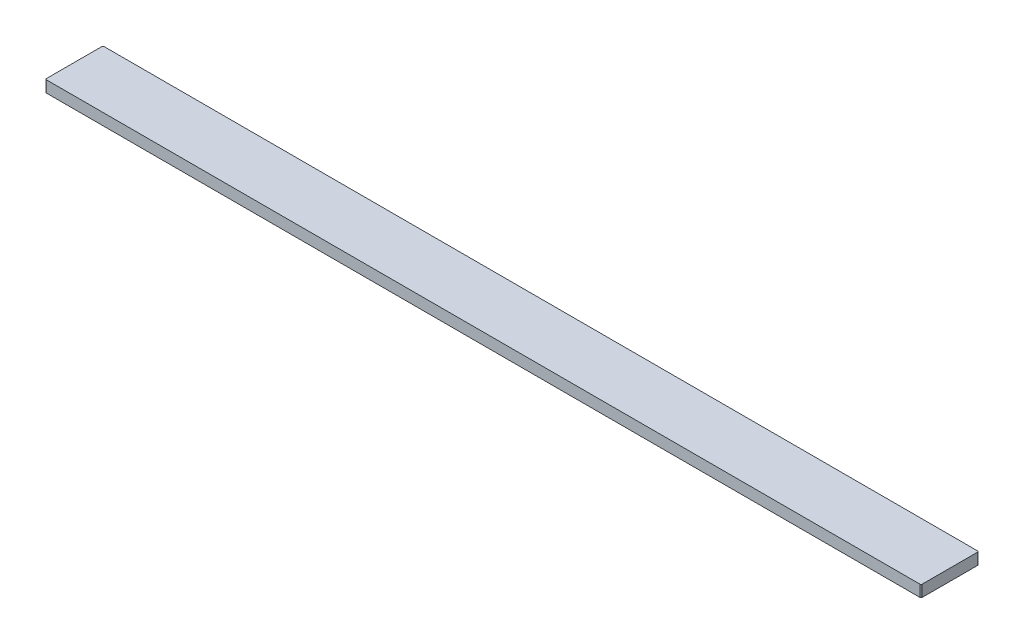
ISO-10303-21;
HEADER;
FILE_DESCRIPTION(('STEP AP214'),'2;1');
FILE_NAME('part.step','',(''),(''),'','','');
FILE_SCHEMA(('AUTOMOTIVE_DESIGN { 1 0 10303 214 1 1 1 1 }'));
ENDSEC;
DATA;
#1=APPLICATION_CONTEXT('core data for automotive mechanical design processes');
#2=APPLICATION_PROTOCOL_DEFINITION('international standard','automotive_design',2000,#1);
#3=PRODUCT_CONTEXT('',#1,'mechanical');
#4=PRODUCT('Part','Part','',(#3));
#5=PRODUCT_RELATED_PRODUCT_CATEGORY('part','',(#4));
#6=PRODUCT_DEFINITION_FORMATION('','',#4);
#7=PRODUCT_DEFINITION_CONTEXT('part definition',#1,'design');
#8=PRODUCT_DEFINITION('design','',#6,#7);
#9=PRODUCT_DEFINITION_SHAPE('','',#8);
#10=(LENGTH_UNIT() NAMED_UNIT(*) SI_UNIT(.MILLI.,.METRE.));
#11=(NAMED_UNIT(*) PLANE_ANGLE_UNIT() SI_UNIT($,.RADIAN.));
#12=(NAMED_UNIT(*) SI_UNIT($,.STERADIAN.) SOLID_ANGLE_UNIT());
#13=UNCERTAINTY_MEASURE_WITH_UNIT(LENGTH_MEASURE(1.E-05),#10,'distance_accuracy_value','');
#14=(GEOMETRIC_REPRESENTATION_CONTEXT(3) GLOBAL_UNCERTAINTY_ASSIGNED_CONTEXT((#13)) GLOBAL_UNIT_ASSIGNED_CONTEXT((#10,
#11,#12)) REPRESENTATION_CONTEXT('',''));
#15=CARTESIAN_POINT('',(0.,0.,0.));
#16=DIRECTION('',(0.,0.,1.));
#17=DIRECTION('',(1.,0.,0.));
#18=AXIS2_PLACEMENT_3D('',#15,#16,#17);
#19=CARTESIAN_POINT('',(-380.,-10.,-50.));
#20=DIRECTION('',(-1.,0.,0.));
#21=DIRECTION('',(0.,0.,1.));
#22=AXIS2_PLACEMENT_3D('',#19,#20,#21);
#23=PLANE('',#22);
#24=DIRECTION('',(0.,0.,1.));
#25=VECTOR('',#24,1.);
#26=CARTESIAN_POINT('',(-380.,0.,-50.));
#27=LINE('',#26,#25);
#28=CARTESIAN_POINT('',(-380.,0.,-49.));
#29=VERTEX_POINT('',#28);
#30=CARTESIAN_POINT('',(-380.,0.,-1.));
#31=VERTEX_POINT('',#30);
#32=EDGE_CURVE('E156',#29,#31,#27,.T.);
#33=ORIENTED_EDGE('',*,*,#32,.F.);
#34=DIRECTION('',(0.,1.,0.));
#35=VECTOR('',#34,1.);
#36=CARTESIAN_POINT('',(-380.,-10.,-49.));
#37=LINE('',#36,#35);
#38=CARTESIAN_POINT('',(-380.,-10.,-49.));
#39=VERTEX_POINT('',#38);
#40=EDGE_CURVE('E11',#29,#39,#37,.F.);
#41=ORIENTED_EDGE('',*,*,#40,.T.);
#42=DIRECTION('',(0.,0.,1.));
#43=VECTOR('',#42,1.);
#44=CARTESIAN_POINT('',(-380.,-10.,-50.));
#45=LINE('',#44,#43);
#46=CARTESIAN_POINT('',(-380.,-10.,-1.));
#47=VERTEX_POINT('',#46);
#48=EDGE_CURVE('E159',#39,#47,#45,.T.);
#49=ORIENTED_EDGE('',*,*,#48,.T.);
#50=DIRECTION('',(0.,1.,0.));
#51=VECTOR('',#50,1.);
#52=CARTESIAN_POINT('',(-380.,-10.,-1.));
#53=LINE('',#52,#51);
#54=EDGE_CURVE('E44',#47,#31,#53,.T.);
#55=ORIENTED_EDGE('',*,*,#54,.T.);
#56=EDGE_LOOP('',(#33,#41,#49,#55));
#57=FACE_BOUND('',#56,.T.);
#58=ADVANCED_FACE('F36',(#57),#23,.T.);
#59=CARTESIAN_POINT('',(-380.,-10.,-50.));
#60=DIRECTION('',(0.,0.,-1.));
#61=DIRECTION('',(-1.,0.,0.));
#62=AXIS2_PLACEMENT_3D('',#59,#60,#61);
#63=PLANE('',#62);
#64=DIRECTION('',(-1.,0.,0.));
#65=VECTOR('',#64,1.);
#66=CARTESIAN_POINT('',(-380.,0.,-50.));
#67=LINE('',#66,#65);
#68=CARTESIAN_POINT('',(379.,0.,-50.));
#69=VERTEX_POINT('',#68);
#70=CARTESIAN_POINT('',(-379.,0.,-50.));
#71=VERTEX_POINT('',#70);
#72=EDGE_CURVE('E121',#69,#71,#67,.T.);
#73=ORIENTED_EDGE('',*,*,#72,.F.);
#74=DIRECTION('',(0.,1.,0.));
#75=VECTOR('',#74,1.);
#76=CARTESIAN_POINT('',(379.,-10.,-50.));
#77=LINE('',#76,#75);
#78=CARTESIAN_POINT('',(379.,-10.,-50.));
#79=VERTEX_POINT('',#78);
#80=EDGE_CURVE('E139',#69,#79,#77,.F.);
#81=ORIENTED_EDGE('',*,*,#80,.T.);
#82=DIRECTION('',(-1.,0.,0.));
#83=VECTOR('',#82,1.);
#84=CARTESIAN_POINT('',(-380.,-10.,-50.));
#85=LINE('',#84,#83);
#86=CARTESIAN_POINT('',(-379.,-10.,-50.));
#87=VERTEX_POINT('',#86);
#88=EDGE_CURVE('E124',#79,#87,#85,.T.);
#89=ORIENTED_EDGE('',*,*,#88,.T.);
#90=DIRECTION('',(0.,1.,0.));
#91=VECTOR('',#90,1.);
#92=CARTESIAN_POINT('',(-379.,-10.,-50.));
#93=LINE('',#92,#91);
#94=EDGE_CURVE('E136',#87,#71,#93,.T.);
#95=ORIENTED_EDGE('',*,*,#94,.T.);
#96=EDGE_LOOP('',(#73,#81,#89,#95));
#97=FACE_BOUND('',#96,.T.);
#98=ADVANCED_FACE('F172',(#97),#63,.T.);
#99=CARTESIAN_POINT('',(380.,-10.,-50.));
#100=DIRECTION('',(1.,0.,0.));
#101=DIRECTION('',(0.,0.,-1.));
#102=AXIS2_PLACEMENT_3D('',#99,#100,#101);
#103=PLANE('',#102);
#104=DIRECTION('',(0.,0.,-1.));
#105=VECTOR('',#104,1.);
#106=CARTESIAN_POINT('',(380.,-10.,-50.));
#107=LINE('',#106,#105);
#108=CARTESIAN_POINT('',(380.,-10.,-1.));
#109=VERTEX_POINT('',#108);
#110=CARTESIAN_POINT('',(380.,-10.,-49.));
#111=VERTEX_POINT('',#110);
#112=EDGE_CURVE('E129',#109,#111,#107,.T.);
#113=ORIENTED_EDGE('',*,*,#112,.T.);
#114=DIRECTION('',(0.,1.,0.));
#115=VECTOR('',#114,1.);
#116=CARTESIAN_POINT('',(380.,-10.,-49.));
#117=LINE('',#116,#115);
#118=CARTESIAN_POINT('',(380.,0.,-49.));
#119=VERTEX_POINT('',#118);
#120=EDGE_CURVE('E120',#111,#119,#117,.T.);
#121=ORIENTED_EDGE('',*,*,#120,.T.);
#122=DIRECTION('',(0.,0.,-1.));
#123=VECTOR('',#122,1.);
#124=CARTESIAN_POINT('',(380.,0.,-50.));
#125=LINE('',#124,#123);
#126=CARTESIAN_POINT('',(380.,0.,-1.));
#127=VERTEX_POINT('',#126);
#128=EDGE_CURVE('E105',#127,#119,#125,.T.);
#129=ORIENTED_EDGE('',*,*,#128,.F.);
#130=DIRECTION('',(0.,1.,0.));
#131=VECTOR('',#130,1.);
#132=CARTESIAN_POINT('',(380.,-10.,-1.));
#133=LINE('',#132,#131);
#134=EDGE_CURVE('E118',#127,#109,#133,.F.);
#135=ORIENTED_EDGE('',*,*,#134,.T.);
#136=EDGE_LOOP('',(#113,#121,#129,#135));
#137=FACE_BOUND('',#136,.T.);
#138=ADVANCED_FACE('F117',(#137),#103,.T.);
#139=CARTESIAN_POINT('',(-380.,-10.,0.));
#140=DIRECTION('',(0.,0.,1.));
#141=DIRECTION('',(1.,0.,0.));
#142=AXIS2_PLACEMENT_3D('',#139,#140,#141);
#143=PLANE('',#142);
#144=DIRECTION('',(1.,0.,0.));
#145=VECTOR('',#144,1.);
#146=CARTESIAN_POINT('',(-380.,-10.,0.));
#147=LINE('',#146,#145);
#148=CARTESIAN_POINT('',(-379.,-10.,0.));
#149=VERTEX_POINT('',#148);
#150=CARTESIAN_POINT('',(379.,-10.,0.));
#151=VERTEX_POINT('',#150);
#152=EDGE_CURVE('E167',#149,#151,#147,.T.);
#153=ORIENTED_EDGE('',*,*,#152,.T.);
#154=DIRECTION('',(0.,1.,0.));
#155=VECTOR('',#154,1.);
#156=CARTESIAN_POINT('',(379.,-10.,0.));
#157=LINE('',#156,#155);
#158=CARTESIAN_POINT('',(379.,0.,0.));
#159=VERTEX_POINT('',#158);
#160=EDGE_CURVE('E149',#151,#159,#157,.T.);
#161=ORIENTED_EDGE('',*,*,#160,.T.);
#162=DIRECTION('',(1.,0.,0.));
#163=VECTOR('',#162,1.);
#164=CARTESIAN_POINT('',(-380.,0.,0.));
#165=LINE('',#164,#163);
#166=CARTESIAN_POINT('',(-379.,0.,0.));
#167=VERTEX_POINT('',#166);
#168=EDGE_CURVE('E106',#167,#159,#165,.T.);
#169=ORIENTED_EDGE('',*,*,#168,.F.);
#170=DIRECTION('',(0.,1.,0.));
#171=VECTOR('',#170,1.);
#172=CARTESIAN_POINT('',(-379.,-10.,0.));
#173=LINE('',#172,#171);
#174=EDGE_CURVE('E58',#167,#149,#173,.F.);
#175=ORIENTED_EDGE('',*,*,#174,.T.);
#176=EDGE_LOOP('',(#153,#161,#169,#175));
#177=FACE_BOUND('',#176,.T.);
#178=ADVANCED_FACE('F194',(#177),#143,.T.);
#179=CARTESIAN_POINT('',(0.,-10.,0.));
#180=DIRECTION('',(0.,1.,0.));
#181=DIRECTION('',(0.,0.,1.));
#182=AXIS2_PLACEMENT_3D('',#179,#180,#181);
#183=PLANE('',#182);
#184=ORIENTED_EDGE('',*,*,#88,.F.);
#185=CARTESIAN_POINT('',(379.,-10.,-49.));
#186=DIRECTION('',(0.,1.,0.));
#187=DIRECTION('',(0.,0.,1.));
#188=AXIS2_PLACEMENT_3D('',#185,#186,#187);
#189=CIRCLE('',#188,1.);
#190=EDGE_CURVE('E146',#79,#111,#189,.F.);
#191=ORIENTED_EDGE('',*,*,#190,.T.);
#192=ORIENTED_EDGE('',*,*,#112,.F.);
#193=CARTESIAN_POINT('',(379.,-10.,-1.));
#194=DIRECTION('',(0.,1.,0.));
#195=DIRECTION('',(0.,0.,1.));
#196=AXIS2_PLACEMENT_3D('',#193,#194,#195);
#197=CIRCLE('',#196,1.);
#198=EDGE_CURVE('E51',#109,#151,#197,.F.);
#199=ORIENTED_EDGE('',*,*,#198,.T.);
#200=ORIENTED_EDGE('',*,*,#152,.F.);
#201=CARTESIAN_POINT('',(-379.,-10.,-1.));
#202=DIRECTION('',(0.,1.,0.));
#203=DIRECTION('',(0.,0.,1.));
#204=AXIS2_PLACEMENT_3D('',#201,#202,#203);
#205=CIRCLE('',#204,1.);
#206=EDGE_CURVE('E141',#149,#47,#205,.F.);
#207=ORIENTED_EDGE('',*,*,#206,.T.);
#208=ORIENTED_EDGE('',*,*,#48,.F.);
#209=CARTESIAN_POINT('',(-379.,-10.,-49.));
#210=DIRECTION('',(0.,1.,0.));
#211=DIRECTION('',(0.,0.,1.));
#212=AXIS2_PLACEMENT_3D('',#209,#210,#211);
#213=CIRCLE('',#212,1.);
#214=EDGE_CURVE('E143',#39,#87,#213,.F.);
#215=ORIENTED_EDGE('',*,*,#214,.T.);
#216=EDGE_LOOP('',(#184,#191,#192,#199,#200,#207,#208,#215));
#217=FACE_BOUND('',#216,.T.);
#218=ADVANCED_FACE('F178',(#217),#183,.F.);
#219=CARTESIAN_POINT('',(0.,0.,0.));
#220=DIRECTION('',(0.,1.,0.));
#221=DIRECTION('',(0.,0.,1.));
#222=AXIS2_PLACEMENT_3D('',#219,#220,#221);
#223=PLANE('',#222);
#224=ORIENTED_EDGE('',*,*,#128,.T.);
#225=CARTESIAN_POINT('',(379.,0.,-49.));
#226=DIRECTION('',(0.,1.,0.));
#227=DIRECTION('',(0.,0.,1.));
#228=AXIS2_PLACEMENT_3D('',#225,#226,#227);
#229=CIRCLE('',#228,1.);
#230=EDGE_CURVE('E111',#119,#69,#229,.T.);
#231=ORIENTED_EDGE('',*,*,#230,.T.);
#232=ORIENTED_EDGE('',*,*,#72,.T.);
#233=CARTESIAN_POINT('',(-379.,0.,-49.));
#234=DIRECTION('',(0.,1.,0.));
#235=DIRECTION('',(0.,0.,1.));
#236=AXIS2_PLACEMENT_3D('',#233,#234,#235);
#237=CIRCLE('',#236,1.);
#238=EDGE_CURVE('E112',#71,#29,#237,.T.);
#239=ORIENTED_EDGE('',*,*,#238,.T.);
#240=ORIENTED_EDGE('',*,*,#32,.T.);
#241=CARTESIAN_POINT('',(-379.,0.,-1.));
#242=DIRECTION('',(0.,1.,0.));
#243=DIRECTION('',(0.,0.,1.));
#244=AXIS2_PLACEMENT_3D('',#241,#242,#243);
#245=CIRCLE('',#244,1.);
#246=EDGE_CURVE('E126',#31,#167,#245,.T.);
#247=ORIENTED_EDGE('',*,*,#246,.T.);
#248=ORIENTED_EDGE('',*,*,#168,.T.);
#249=CARTESIAN_POINT('',(379.,0.,-1.));
#250=DIRECTION('',(0.,1.,0.));
#251=DIRECTION('',(0.,0.,1.));
#252=AXIS2_PLACEMENT_3D('',#249,#250,#251);
#253=CIRCLE('',#252,1.);
#254=EDGE_CURVE('E102',#159,#127,#253,.T.);
#255=ORIENTED_EDGE('',*,*,#254,.T.);
#256=EDGE_LOOP('',(#224,#231,#232,#239,#240,#247,#248,#255));
#257=FACE_BOUND('',#256,.T.);
#258=ADVANCED_FACE('F104',(#257),#223,.T.);
#259=CARTESIAN_POINT('',(379.,-10.,-49.));
#260=DIRECTION('',(0.,1.,0.));
#261=DIRECTION('',(0.,0.,1.));
#262=AXIS2_PLACEMENT_3D('',#259,#260,#261);
#263=CYLINDRICAL_SURFACE('',#262,1.);
#264=ORIENTED_EDGE('',*,*,#190,.F.);
#265=ORIENTED_EDGE('',*,*,#80,.F.);
#266=ORIENTED_EDGE('',*,*,#230,.F.);
#267=ORIENTED_EDGE('',*,*,#120,.F.);
#268=EDGE_LOOP('',(#264,#265,#266,#267));
#269=FACE_BOUND('',#268,.T.);
#270=ADVANCED_FACE('F177',(#269),#263,.T.);
#271=CARTESIAN_POINT('',(379.,-10.,-1.));
#272=DIRECTION('',(0.,1.,0.));
#273=DIRECTION('',(0.,0.,1.));
#274=AXIS2_PLACEMENT_3D('',#271,#272,#273);
#275=CYLINDRICAL_SURFACE('',#274,1.);
#276=ORIENTED_EDGE('',*,*,#198,.F.);
#277=ORIENTED_EDGE('',*,*,#134,.F.);
#278=ORIENTED_EDGE('',*,*,#254,.F.);
#279=ORIENTED_EDGE('',*,*,#160,.F.);
#280=EDGE_LOOP('',(#276,#277,#278,#279));
#281=FACE_BOUND('',#280,.T.);
#282=ADVANCED_FACE('F123',(#281),#275,.T.);
#283=CARTESIAN_POINT('',(-379.,-10.,-49.));
#284=DIRECTION('',(0.,1.,0.));
#285=DIRECTION('',(0.,0.,1.));
#286=AXIS2_PLACEMENT_3D('',#283,#284,#285);
#287=CYLINDRICAL_SURFACE('',#286,1.);
#288=ORIENTED_EDGE('',*,*,#214,.F.);
#289=ORIENTED_EDGE('',*,*,#40,.F.);
#290=ORIENTED_EDGE('',*,*,#238,.F.);
#291=ORIENTED_EDGE('',*,*,#94,.F.);
#292=EDGE_LOOP('',(#288,#289,#290,#291));
#293=FACE_BOUND('',#292,.T.);
#294=ADVANCED_FACE('F181',(#293),#287,.T.);
#295=CARTESIAN_POINT('',(-379.,-10.,-1.));
#296=DIRECTION('',(0.,1.,0.));
#297=DIRECTION('',(0.,0.,1.));
#298=AXIS2_PLACEMENT_3D('',#295,#296,#297);
#299=CYLINDRICAL_SURFACE('',#298,1.);
#300=ORIENTED_EDGE('',*,*,#206,.F.);
#301=ORIENTED_EDGE('',*,*,#174,.F.);
#302=ORIENTED_EDGE('',*,*,#246,.F.);
#303=ORIENTED_EDGE('',*,*,#54,.F.);
#304=EDGE_LOOP('',(#300,#301,#302,#303));
#305=FACE_BOUND('',#304,.T.);
#306=ADVANCED_FACE('F38',(#305),#299,.T.);
#307=CLOSED_SHELL('',(#58,#98,#138,#178,#218,#258,#270,#282,#294,#306));
#308=MANIFOLD_SOLID_BREP('B2',#307);
#309=ADVANCED_BREP_SHAPE_REPRESENTATION('',(#18,#308),#14);
#310=SHAPE_DEFINITION_REPRESENTATION(#9,#309);
ENDSEC;
END-ISO-10303-21;
